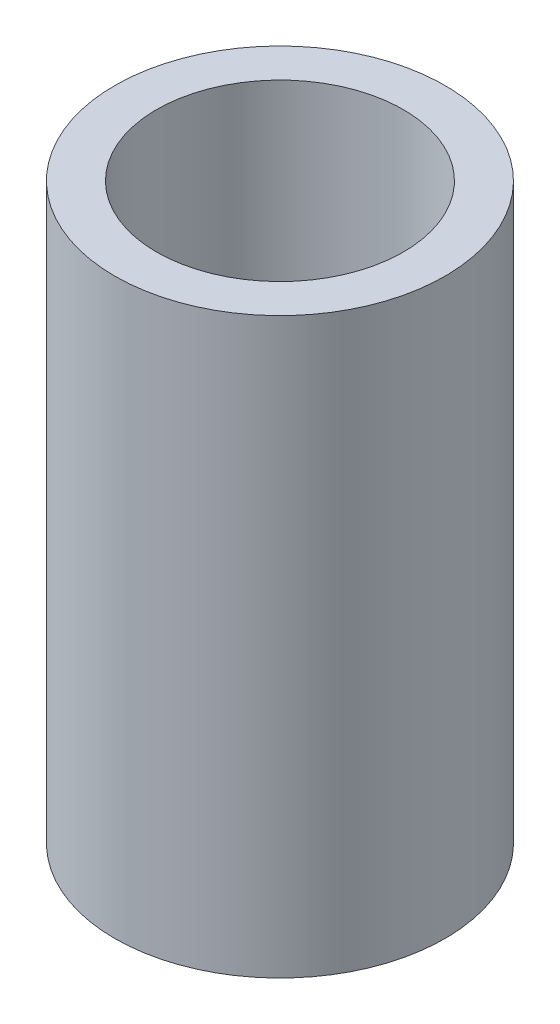
ISO-10303-21;
HEADER;
FILE_DESCRIPTION(('STEP AP214'),'2;1');
FILE_NAME('part.step','',(''),(''),'','','');
FILE_SCHEMA(('AUTOMOTIVE_DESIGN { 1 0 10303 214 1 1 1 1 }'));
ENDSEC;
DATA;
#1=APPLICATION_CONTEXT('core data for automotive mechanical design processes');
#2=APPLICATION_PROTOCOL_DEFINITION('international standard','automotive_design',2000,#1);
#3=PRODUCT_CONTEXT('',#1,'mechanical');
#4=PRODUCT('Part','Part','',(#3));
#5=PRODUCT_RELATED_PRODUCT_CATEGORY('part','',(#4));
#6=PRODUCT_DEFINITION_FORMATION('','',#4);
#7=PRODUCT_DEFINITION_CONTEXT('part definition',#1,'design');
#8=PRODUCT_DEFINITION('design','',#6,#7);
#9=PRODUCT_DEFINITION_SHAPE('','',#8);
#10=(LENGTH_UNIT() NAMED_UNIT(*) SI_UNIT(.MILLI.,.METRE.));
#11=(NAMED_UNIT(*) PLANE_ANGLE_UNIT() SI_UNIT($,.RADIAN.));
#12=(NAMED_UNIT(*) SI_UNIT($,.STERADIAN.) SOLID_ANGLE_UNIT());
#13=UNCERTAINTY_MEASURE_WITH_UNIT(LENGTH_MEASURE(1.E-05),#10,'distance_accuracy_value','');
#14=(GEOMETRIC_REPRESENTATION_CONTEXT(3) GLOBAL_UNCERTAINTY_ASSIGNED_CONTEXT((#13)) GLOBAL_UNIT_ASSIGNED_CONTEXT((#10,
#11,#12)) REPRESENTATION_CONTEXT('',''));
#15=CARTESIAN_POINT('',(0.,0.,0.));
#16=DIRECTION('',(0.,0.,1.));
#17=DIRECTION('',(1.,0.,0.));
#18=AXIS2_PLACEMENT_3D('',#15,#16,#17);
#19=CARTESIAN_POINT('',(0.,9.652,0.));
#20=DIRECTION('',(0.,1.,0.));
#21=DIRECTION('',(0.,0.,1.));
#22=AXIS2_PLACEMENT_3D('',#19,#20,#21);
#23=PLANE('',#22);
#24=CARTESIAN_POINT('',(0.,9.652,0.));
#25=DIRECTION('',(0.,1.,0.));
#26=DIRECTION('',(0.,0.,1.));
#27=AXIS2_PLACEMENT_3D('',#24,#25,#26);
#28=CIRCLE('',#27,2.778125);
#29=CARTESIAN_POINT('',(0.,9.652,2.778125));
#30=VERTEX_POINT('',#29);
#31=EDGE_CURVE('E10',#30,#30,#28,.T.);
#32=ORIENTED_EDGE('',*,*,#31,.T.);
#33=EDGE_LOOP('',(#32));
#34=FACE_BOUND('',#33,.T.);
#35=CARTESIAN_POINT('',(0.,9.652,0.));
#36=DIRECTION('',(0.,1.,0.));
#37=DIRECTION('',(0.,0.,1.));
#38=AXIS2_PLACEMENT_3D('',#35,#36,#37);
#39=CIRCLE('',#38,2.07645);
#40=CARTESIAN_POINT('',(0.,9.652,2.07645));
#41=VERTEX_POINT('',#40);
#42=EDGE_CURVE('E42',#41,#41,#39,.T.);
#43=ORIENTED_EDGE('',*,*,#42,.F.);
#44=EDGE_LOOP('',(#43));
#45=FACE_BOUND('',#44,.T.);
#46=ADVANCED_FACE('F31',(#34,#45),#23,.T.);
#47=CARTESIAN_POINT('',(0.,0.,0.));
#48=DIRECTION('',(0.,1.,0.));
#49=DIRECTION('',(0.,0.,1.));
#50=AXIS2_PLACEMENT_3D('',#47,#48,#49);
#51=PLANE('',#50);
#52=CARTESIAN_POINT('',(0.,0.,0.));
#53=DIRECTION('',(0.,1.,0.));
#54=DIRECTION('',(0.,0.,1.));
#55=AXIS2_PLACEMENT_3D('',#52,#53,#54);
#56=CIRCLE('',#55,2.778125);
#57=CARTESIAN_POINT('',(0.,0.,2.778125));
#58=VERTEX_POINT('',#57);
#59=EDGE_CURVE('E35',#58,#58,#56,.T.);
#60=ORIENTED_EDGE('',*,*,#59,.F.);
#61=EDGE_LOOP('',(#60));
#62=FACE_BOUND('',#61,.T.);
#63=CARTESIAN_POINT('',(0.,0.,0.));
#64=DIRECTION('',(0.,1.,0.));
#65=DIRECTION('',(0.,0.,1.));
#66=AXIS2_PLACEMENT_3D('',#63,#64,#65);
#67=CIRCLE('',#66,2.07645);
#68=CARTESIAN_POINT('',(0.,0.,2.07645));
#69=VERTEX_POINT('',#68);
#70=EDGE_CURVE('E44',#69,#69,#67,.T.);
#71=ORIENTED_EDGE('',*,*,#70,.T.);
#72=EDGE_LOOP('',(#71));
#73=FACE_BOUND('',#72,.T.);
#74=ADVANCED_FACE('F54',(#62,#73),#51,.F.);
#75=CARTESIAN_POINT('',(0.,9.652,0.));
#76=DIRECTION('',(0.,-1.,0.));
#77=DIRECTION('',(0.,0.,-1.));
#78=AXIS2_PLACEMENT_3D('',#75,#76,#77);
#79=CYLINDRICAL_SURFACE('',#78,2.778125);
#80=ORIENTED_EDGE('',*,*,#31,.F.);
#81=EDGE_LOOP('',(#80));
#82=FACE_BOUND('',#81,.T.);
#83=ORIENTED_EDGE('',*,*,#59,.T.);
#84=EDGE_LOOP('',(#83));
#85=FACE_BOUND('',#84,.T.);
#86=ADVANCED_FACE('F33',(#82,#85),#79,.T.);
#87=CARTESIAN_POINT('',(0.,9.652,0.));
#88=DIRECTION('',(0.,-1.,0.));
#89=DIRECTION('',(0.,0.,-1.));
#90=AXIS2_PLACEMENT_3D('',#87,#88,#89);
#91=CYLINDRICAL_SURFACE('',#90,2.07645);
#92=ORIENTED_EDGE('',*,*,#42,.T.);
#93=EDGE_LOOP('',(#92));
#94=FACE_BOUND('',#93,.T.);
#95=ORIENTED_EDGE('',*,*,#70,.F.);
#96=EDGE_LOOP('',(#95));
#97=FACE_BOUND('',#96,.T.);
#98=ADVANCED_FACE('F50',(#94,#97),#91,.F.);
#99=CLOSED_SHELL('',(#46,#74,#86,#98));
#100=MANIFOLD_SOLID_BREP('B2',#99);
#101=ADVANCED_BREP_SHAPE_REPRESENTATION('',(#18,#100),#14);
#102=SHAPE_DEFINITION_REPRESENTATION(#9,#101);
ENDSEC;
END-ISO-10303-21;
